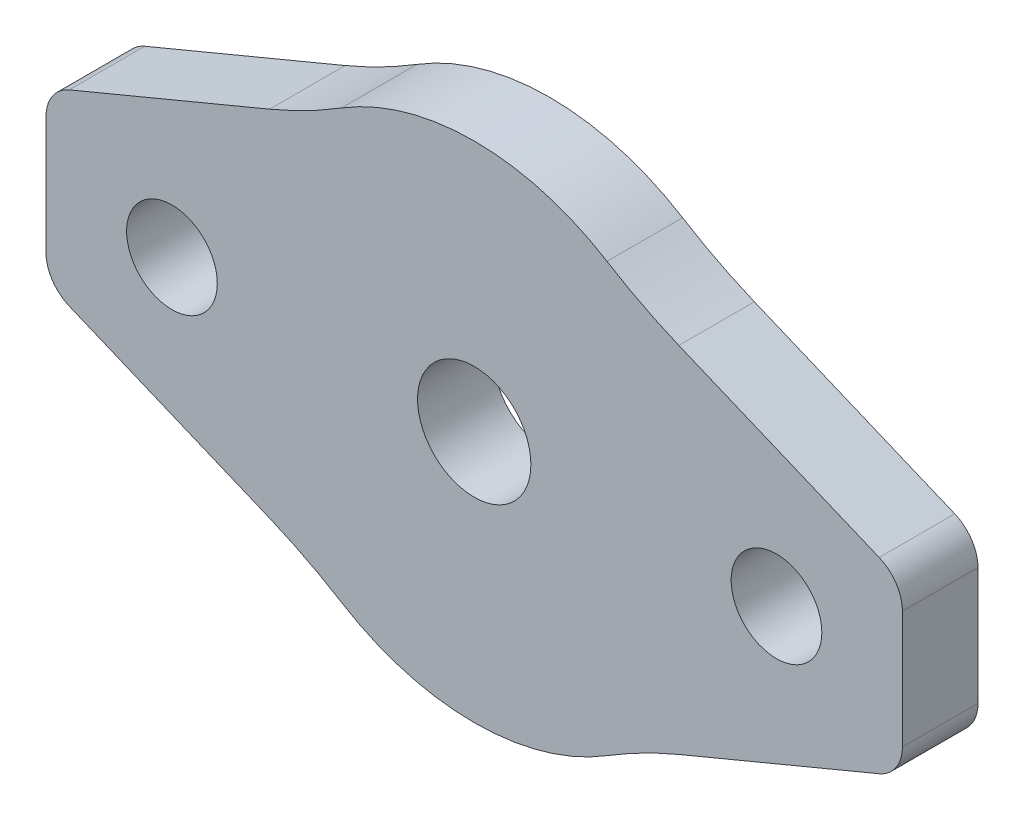
ISO-10303-21;
HEADER;
FILE_DESCRIPTION(('STEP AP214'),'2;1');
FILE_NAME('part.step','',(''),(''),'','','');
FILE_SCHEMA(('AUTOMOTIVE_DESIGN { 1 0 10303 214 1 1 1 1 }'));
ENDSEC;
DATA;
#1=APPLICATION_CONTEXT('core data for automotive mechanical design processes');
#2=APPLICATION_PROTOCOL_DEFINITION('international standard','automotive_design',2000,#1);
#3=PRODUCT_CONTEXT('',#1,'mechanical');
#4=PRODUCT('Part','Part','',(#3));
#5=PRODUCT_RELATED_PRODUCT_CATEGORY('part','',(#4));
#6=PRODUCT_DEFINITION_FORMATION('','',#4);
#7=PRODUCT_DEFINITION_CONTEXT('part definition',#1,'design');
#8=PRODUCT_DEFINITION('design','',#6,#7);
#9=PRODUCT_DEFINITION_SHAPE('','',#8);
#10=(LENGTH_UNIT() NAMED_UNIT(*) SI_UNIT(.MILLI.,.METRE.));
#11=(NAMED_UNIT(*) PLANE_ANGLE_UNIT() SI_UNIT($,.RADIAN.));
#12=(NAMED_UNIT(*) SI_UNIT($,.STERADIAN.) SOLID_ANGLE_UNIT());
#13=UNCERTAINTY_MEASURE_WITH_UNIT(LENGTH_MEASURE(1.E-05),#10,'distance_accuracy_value','');
#14=(GEOMETRIC_REPRESENTATION_CONTEXT(3) GLOBAL_UNCERTAINTY_ASSIGNED_CONTEXT((#13)) GLOBAL_UNIT_ASSIGNED_CONTEXT((#10,
#11,#12)) REPRESENTATION_CONTEXT('',''));
#15=CARTESIAN_POINT('',(0.,0.,0.));
#16=DIRECTION('',(0.,0.,1.));
#17=DIRECTION('',(1.,0.,0.));
#18=AXIS2_PLACEMENT_3D('',#15,#16,#17);
#19=CARTESIAN_POINT('',(-78.4823092369038,18.136457393352,3.));
#20=DIRECTION('',(0.,0.,-1.));
#21=DIRECTION('',(-1.,0.,0.));
#22=AXIS2_PLACEMENT_3D('',#19,#20,#21);
#23=CYLINDRICAL_SURFACE('',#22,10.);
#24=CARTESIAN_POINT('',(-78.4823092369038,18.136457393352,0.));
#25=DIRECTION('',(0.,0.,1.));
#26=DIRECTION('',(1.,0.,0.));
#27=AXIS2_PLACEMENT_3D('',#24,#25,#26);
#28=CIRCLE('',#27,10.);
#29=CARTESIAN_POINT('',(-73.2110997052458,26.6343600800953,0.));
#30=VERTEX_POINT('',#29);
#31=CARTESIAN_POINT('',(-83.7535187685618,26.6343600800953,0.));
#32=VERTEX_POINT('',#31);
#33=EDGE_CURVE('E198',#30,#32,#28,.T.);
#34=ORIENTED_EDGE('',*,*,#33,.T.);
#35=DIRECTION('',(0.,0.,-1.));
#36=VECTOR('',#35,1.);
#37=CARTESIAN_POINT('',(-83.7535187685618,26.6343600800953,3.));
#38=LINE('',#37,#36);
#39=CARTESIAN_POINT('',(-83.7535187685618,26.6343600800953,3.));
#40=VERTEX_POINT('',#39);
#41=EDGE_CURVE('E257',#32,#40,#38,.F.);
#42=ORIENTED_EDGE('',*,*,#41,.T.);
#43=CARTESIAN_POINT('',(-78.4823092369038,18.136457393352,3.));
#44=DIRECTION('',(0.,0.,1.));
#45=DIRECTION('',(1.,0.,0.));
#46=AXIS2_PLACEMENT_3D('',#43,#44,#45);
#47=CIRCLE('',#46,10.);
#48=CARTESIAN_POINT('',(-73.2110997052458,26.6343600800953,3.));
#49=VERTEX_POINT('',#48);
#50=EDGE_CURVE('E159',#49,#40,#47,.T.);
#51=ORIENTED_EDGE('',*,*,#50,.F.);
#52=DIRECTION('',(0.,0.,-1.));
#53=VECTOR('',#52,1.);
#54=CARTESIAN_POINT('',(-73.2110997052458,26.6343600800953,3.));
#55=LINE('',#54,#53);
#56=EDGE_CURVE('E254',#49,#30,#55,.T.);
#57=ORIENTED_EDGE('',*,*,#56,.T.);
#58=EDGE_LOOP('',(#34,#42,#51,#57));
#59=FACE_BOUND('',#58,.T.);
#60=ADVANCED_FACE('F35',(#59),#23,.T.);
#61=CARTESIAN_POINT('',(-84.7179179392774,25.9542054137785,3.));
#62=DIRECTION('',(0.384559093085243,-0.923100375866815,0.));
#63=DIRECTION('',(0.923100375866815,0.384559093085243,0.));
#64=AXIS2_PLACEMENT_3D('',#61,#62,#63);
#65=PLANE('',#64);
#66=DIRECTION('',(-0.923100375866815,-0.384559093085243,0.));
#67=VECTOR('',#66,1.);
#68=CARTESIAN_POINT('',(-84.7179179392774,25.9542054137785,3.));
#69=LINE('',#68,#67);
#70=CARTESIAN_POINT('',(-86.6047559701728,25.1681579362455,3.));
#71=VERTEX_POINT('',#70);
#72=CARTESIAN_POINT('',(-94.5591478765317,21.8543972472397,3.));
#73=VERTEX_POINT('',#72);
#74=EDGE_CURVE('E147',#71,#73,#69,.T.);
#75=ORIENTED_EDGE('',*,*,#74,.F.);
#76=DIRECTION('',(0.,0.,1.));
#77=VECTOR('',#76,1.);
#78=CARTESIAN_POINT('',(-86.6047559701728,25.1681579362455,0.));
#79=LINE('',#78,#77);
#80=CARTESIAN_POINT('',(-86.6047559701728,25.1681579362455,0.));
#81=VERTEX_POINT('',#80);
#82=EDGE_CURVE('E252',#71,#81,#79,.F.);
#83=ORIENTED_EDGE('',*,*,#82,.T.);
#84=DIRECTION('',(-0.923100375866815,-0.384559093085243,0.));
#85=VECTOR('',#84,1.);
#86=CARTESIAN_POINT('',(-84.7179179392774,25.9542054137785,0.));
#87=LINE('',#86,#85);
#88=CARTESIAN_POINT('',(-94.5591478765317,21.8543972472397,0.));
#89=VERTEX_POINT('',#88);
#90=EDGE_CURVE('E165',#81,#89,#87,.T.);
#91=ORIENTED_EDGE('',*,*,#90,.T.);
#92=DIRECTION('',(0.,0.,-1.));
#93=VECTOR('',#92,1.);
#94=CARTESIAN_POINT('',(-94.5591478765317,21.8543972472397,3.));
#95=LINE('',#94,#93);
#96=EDGE_CURVE('E162',#73,#89,#95,.T.);
#97=ORIENTED_EDGE('',*,*,#96,.F.);
#98=EDGE_LOOP('',(#75,#83,#91,#97));
#99=FACE_BOUND('',#98,.T.);
#100=ADVANCED_FACE('F163',(#99),#65,.F.);
#101=CARTESIAN_POINT('',(-93.9823092369038,20.4697466834395,3.));
#102=DIRECTION('',(0.,0.,-1.));
#103=DIRECTION('',(-1.,0.,0.));
#104=AXIS2_PLACEMENT_3D('',#101,#102,#103);
#105=CYLINDRICAL_SURFACE('',#104,1.5);
#106=CARTESIAN_POINT('',(-93.9823092369038,20.4697466834395,0.));
#107=DIRECTION('',(0.,0.,1.));
#108=DIRECTION('',(1.,0.,0.));
#109=AXIS2_PLACEMENT_3D('',#106,#107,#108);
#110=CIRCLE('',#109,1.5);
#111=CARTESIAN_POINT('',(-95.4823092369038,20.4697466834395,0.));
#112=VERTEX_POINT('',#111);
#113=EDGE_CURVE('E203',#89,#112,#110,.T.);
#114=ORIENTED_EDGE('',*,*,#113,.T.);
#115=DIRECTION('',(0.,0.,-1.));
#116=VECTOR('',#115,1.);
#117=CARTESIAN_POINT('',(-95.4823092369038,20.4697466834395,3.));
#118=LINE('',#117,#116);
#119=CARTESIAN_POINT('',(-95.4823092369038,20.4697466834395,3.));
#120=VERTEX_POINT('',#119);
#121=EDGE_CURVE('E169',#120,#112,#118,.T.);
#122=ORIENTED_EDGE('',*,*,#121,.F.);
#123=CARTESIAN_POINT('',(-93.9823092369038,20.4697466834395,3.));
#124=DIRECTION('',(0.,0.,1.));
#125=DIRECTION('',(1.,0.,0.));
#126=AXIS2_PLACEMENT_3D('',#123,#124,#125);
#127=CIRCLE('',#126,1.5);
#128=EDGE_CURVE('E151',#73,#120,#127,.T.);
#129=ORIENTED_EDGE('',*,*,#128,.F.);
#130=ORIENTED_EDGE('',*,*,#96,.T.);
#131=EDGE_LOOP('',(#114,#122,#129,#130));
#132=FACE_BOUND('',#131,.T.);
#133=ADVANCED_FACE('F171',(#132),#105,.T.);
#134=CARTESIAN_POINT('',(-95.4823092369038,20.4697466834395,3.));
#135=DIRECTION('',(1.,0.,0.));
#136=DIRECTION('',(0.,0.,-1.));
#137=AXIS2_PLACEMENT_3D('',#134,#135,#136);
#138=PLANE('',#137);
#139=DIRECTION('',(0.,-1.,0.));
#140=VECTOR('',#139,1.);
#141=CARTESIAN_POINT('',(-95.4823092369038,20.4697466834395,0.));
#142=LINE('',#141,#140);
#143=CARTESIAN_POINT('',(-95.4823092369038,15.8031681032646,0.));
#144=VERTEX_POINT('',#143);
#145=EDGE_CURVE('E205',#112,#144,#142,.T.);
#146=ORIENTED_EDGE('',*,*,#145,.T.);
#147=DIRECTION('',(0.,0.,-1.));
#148=VECTOR('',#147,1.);
#149=CARTESIAN_POINT('',(-95.4823092369038,15.8031681032646,3.));
#150=LINE('',#149,#148);
#151=CARTESIAN_POINT('',(-95.4823092369038,15.8031681032646,3.));
#152=VERTEX_POINT('',#151);
#153=EDGE_CURVE('E239',#152,#144,#150,.T.);
#154=ORIENTED_EDGE('',*,*,#153,.F.);
#155=DIRECTION('',(0.,-1.,0.));
#156=VECTOR('',#155,1.);
#157=CARTESIAN_POINT('',(-95.4823092369038,20.4697466834395,3.));
#158=LINE('',#157,#156);
#159=EDGE_CURVE('E174',#120,#152,#158,.T.);
#160=ORIENTED_EDGE('',*,*,#159,.F.);
#161=ORIENTED_EDGE('',*,*,#121,.T.);
#162=EDGE_LOOP('',(#146,#154,#160,#161));
#163=FACE_BOUND('',#162,.T.);
#164=ADVANCED_FACE('F394',(#163),#138,.F.);
#165=CARTESIAN_POINT('',(-93.9823092369038,15.8031681032646,3.));
#166=DIRECTION('',(0.,0.,-1.));
#167=DIRECTION('',(-1.,0.,0.));
#168=AXIS2_PLACEMENT_3D('',#165,#166,#167);
#169=CYLINDRICAL_SURFACE('',#168,1.5);
#170=CARTESIAN_POINT('',(-93.9823092369038,15.8031681032646,0.));
#171=DIRECTION('',(0.,0.,1.));
#172=DIRECTION('',(1.,0.,0.));
#173=AXIS2_PLACEMENT_3D('',#170,#171,#172);
#174=CIRCLE('',#173,1.5);
#175=CARTESIAN_POINT('',(-94.5591478765317,14.4185175394644,0.));
#176=VERTEX_POINT('',#175);
#177=EDGE_CURVE('E207',#144,#176,#174,.T.);
#178=ORIENTED_EDGE('',*,*,#177,.T.);
#179=DIRECTION('',(0.,0.,-1.));
#180=VECTOR('',#179,1.);
#181=CARTESIAN_POINT('',(-94.5591478765317,14.4185175394644,3.));
#182=LINE('',#181,#180);
#183=CARTESIAN_POINT('',(-94.5591478765317,14.4185175394644,3.));
#184=VERTEX_POINT('',#183);
#185=EDGE_CURVE('E236',#184,#176,#182,.T.);
#186=ORIENTED_EDGE('',*,*,#185,.F.);
#187=CARTESIAN_POINT('',(-93.9823092369038,15.8031681032646,3.));
#188=DIRECTION('',(0.,0.,1.));
#189=DIRECTION('',(1.,0.,0.));
#190=AXIS2_PLACEMENT_3D('',#187,#188,#189);
#191=CIRCLE('',#190,1.5);
#192=EDGE_CURVE('E176',#152,#184,#191,.T.);
#193=ORIENTED_EDGE('',*,*,#192,.F.);
#194=ORIENTED_EDGE('',*,*,#153,.T.);
#195=EDGE_LOOP('',(#178,#186,#193,#194));
#196=FACE_BOUND('',#195,.T.);
#197=ADVANCED_FACE('F390',(#196),#169,.T.);
#198=CARTESIAN_POINT('',(-84.7179179392774,10.3187093729256,3.));
#199=DIRECTION('',(0.384559093085243,0.923100375866815,0.));
#200=DIRECTION('',(-0.923100375866815,0.384559093085243,0.));
#201=AXIS2_PLACEMENT_3D('',#198,#199,#200);
#202=PLANE('',#201);
#203=DIRECTION('',(0.923100375866815,-0.384559093085243,0.));
#204=VECTOR('',#203,1.);
#205=CARTESIAN_POINT('',(-84.7179179392774,10.3187093729256,0.));
#206=LINE('',#205,#204);
#207=CARTESIAN_POINT('',(-86.6047559701728,11.1047568504586,0.));
#208=VERTEX_POINT('',#207);
#209=EDGE_CURVE('E209',#176,#208,#206,.T.);
#210=ORIENTED_EDGE('',*,*,#209,.T.);
#211=DIRECTION('',(0.,0.,1.));
#212=VECTOR('',#211,1.);
#213=CARTESIAN_POINT('',(-86.6047559701728,11.1047568504586,3.));
#214=LINE('',#213,#212);
#215=CARTESIAN_POINT('',(-86.6047559701728,11.1047568504586,3.));
#216=VERTEX_POINT('',#215);
#217=EDGE_CURVE('E250',#208,#216,#214,.T.);
#218=ORIENTED_EDGE('',*,*,#217,.T.);
#219=DIRECTION('',(0.923100375866815,-0.384559093085243,0.));
#220=VECTOR('',#219,1.);
#221=CARTESIAN_POINT('',(-84.7179179392774,10.3187093729256,3.));
#222=LINE('',#221,#220);
#223=EDGE_CURVE('E181',#184,#216,#222,.T.);
#224=ORIENTED_EDGE('',*,*,#223,.F.);
#225=ORIENTED_EDGE('',*,*,#185,.T.);
#226=EDGE_LOOP('',(#210,#218,#224,#225));
#227=FACE_BOUND('',#226,.T.);
#228=ADVANCED_FACE('F386',(#227),#202,.F.);
#229=CARTESIAN_POINT('',(-78.4823092369038,18.136457393352,3.));
#230=DIRECTION('',(0.,0.,-1.));
#231=DIRECTION('',(-1.,0.,0.));
#232=AXIS2_PLACEMENT_3D('',#229,#230,#231);
#233=CYLINDRICAL_SURFACE('',#232,10.);
#234=CARTESIAN_POINT('',(-78.4823092369038,18.136457393352,0.));
#235=DIRECTION('',(0.,0.,1.));
#236=DIRECTION('',(1.,0.,0.));
#237=AXIS2_PLACEMENT_3D('',#234,#235,#236);
#238=CIRCLE('',#237,10.);
#239=CARTESIAN_POINT('',(-83.7535187685618,9.63855470660879,0.));
#240=VERTEX_POINT('',#239);
#241=CARTESIAN_POINT('',(-73.2110997052458,9.63855470660878,0.));
#242=VERTEX_POINT('',#241);
#243=EDGE_CURVE('E212',#240,#242,#238,.T.);
#244=ORIENTED_EDGE('',*,*,#243,.T.);
#245=DIRECTION('',(0.,0.,-1.));
#246=VECTOR('',#245,1.);
#247=CARTESIAN_POINT('',(-73.2110997052458,9.63855470660878,3.));
#248=LINE('',#247,#246);
#249=CARTESIAN_POINT('',(-73.2110997052458,9.63855470660878,3.));
#250=VERTEX_POINT('',#249);
#251=EDGE_CURVE('E248',#242,#250,#248,.F.);
#252=ORIENTED_EDGE('',*,*,#251,.T.);
#253=CARTESIAN_POINT('',(-78.4823092369038,18.136457393352,3.));
#254=DIRECTION('',(0.,0.,1.));
#255=DIRECTION('',(1.,0.,0.));
#256=AXIS2_PLACEMENT_3D('',#253,#254,#255);
#257=CIRCLE('',#256,10.);
#258=CARTESIAN_POINT('',(-83.7535187685618,9.63855470660879,3.));
#259=VERTEX_POINT('',#258);
#260=EDGE_CURVE('E184',#259,#250,#257,.T.);
#261=ORIENTED_EDGE('',*,*,#260,.F.);
#262=DIRECTION('',(0.,0.,-1.));
#263=VECTOR('',#262,1.);
#264=CARTESIAN_POINT('',(-83.7535187685618,9.63855470660879,3.));
#265=LINE('',#264,#263);
#266=EDGE_CURVE('E245',#259,#240,#265,.T.);
#267=ORIENTED_EDGE('',*,*,#266,.T.);
#268=EDGE_LOOP('',(#244,#252,#261,#267));
#269=FACE_BOUND('',#268,.T.);
#270=ADVANCED_FACE('F383',(#269),#233,.T.);
#271=CARTESIAN_POINT('',(-62.4054705972759,14.4185175394644,3.));
#272=DIRECTION('',(-0.384559093085243,0.923100375866815,0.));
#273=DIRECTION('',(-0.923100375866815,-0.384559093085243,0.));
#274=AXIS2_PLACEMENT_3D('',#271,#272,#273);
#275=PLANE('',#274);
#276=DIRECTION('',(0.923100375866815,0.384559093085243,0.));
#277=VECTOR('',#276,1.);
#278=CARTESIAN_POINT('',(-62.4054705972759,14.4185175394644,3.));
#279=LINE('',#278,#277);
#280=CARTESIAN_POINT('',(-70.3598625036348,11.1047568504586,3.));
#281=VERTEX_POINT('',#280);
#282=CARTESIAN_POINT('',(-62.4054705972759,14.4185175394644,3.));
#283=VERTEX_POINT('',#282);
#284=EDGE_CURVE('E187',#281,#283,#279,.T.);
#285=ORIENTED_EDGE('',*,*,#284,.F.);
#286=DIRECTION('',(0.,0.,1.));
#287=VECTOR('',#286,1.);
#288=CARTESIAN_POINT('',(-70.3598625036348,11.1047568504586,0.));
#289=LINE('',#288,#287);
#290=CARTESIAN_POINT('',(-70.3598625036348,11.1047568504586,0.));
#291=VERTEX_POINT('',#290);
#292=EDGE_CURVE('E168',#281,#291,#289,.F.);
#293=ORIENTED_EDGE('',*,*,#292,.T.);
#294=DIRECTION('',(0.923100375866815,0.384559093085243,0.));
#295=VECTOR('',#294,1.);
#296=CARTESIAN_POINT('',(-62.4054705972759,14.4185175394644,0.));
#297=LINE('',#296,#295);
#298=CARTESIAN_POINT('',(-62.4054705972759,14.4185175394644,0.));
#299=VERTEX_POINT('',#298);
#300=EDGE_CURVE('E215',#291,#299,#297,.T.);
#301=ORIENTED_EDGE('',*,*,#300,.T.);
#302=DIRECTION('',(0.,0.,-1.));
#303=VECTOR('',#302,1.);
#304=CARTESIAN_POINT('',(-62.4054705972759,14.4185175394644,3.));
#305=LINE('',#304,#303);
#306=EDGE_CURVE('E233',#283,#299,#305,.T.);
#307=ORIENTED_EDGE('',*,*,#306,.F.);
#308=EDGE_LOOP('',(#285,#293,#301,#307));
#309=FACE_BOUND('',#308,.T.);
#310=ADVANCED_FACE('F311',(#309),#275,.F.);
#311=CARTESIAN_POINT('',(-62.9823092369037,15.8031681032646,3.));
#312=DIRECTION('',(0.,0.,-1.));
#313=DIRECTION('',(-1.,0.,0.));
#314=AXIS2_PLACEMENT_3D('',#311,#312,#313);
#315=CYLINDRICAL_SURFACE('',#314,1.5);
#316=CARTESIAN_POINT('',(-62.9823092369037,15.8031681032646,0.));
#317=DIRECTION('',(0.,0.,1.));
#318=DIRECTION('',(1.,0.,0.));
#319=AXIS2_PLACEMENT_3D('',#316,#317,#318);
#320=CIRCLE('',#319,1.5);
#321=CARTESIAN_POINT('',(-61.4823092369037,15.8031681032646,0.));
#322=VERTEX_POINT('',#321);
#323=EDGE_CURVE('E217',#299,#322,#320,.T.);
#324=ORIENTED_EDGE('',*,*,#323,.T.);
#325=DIRECTION('',(0.,0.,-1.));
#326=VECTOR('',#325,1.);
#327=CARTESIAN_POINT('',(-61.4823092369037,15.8031681032646,3.));
#328=LINE('',#327,#326);
#329=CARTESIAN_POINT('',(-61.4823092369037,15.8031681032646,3.));
#330=VERTEX_POINT('',#329);
#331=EDGE_CURVE('E230',#330,#322,#328,.T.);
#332=ORIENTED_EDGE('',*,*,#331,.F.);
#333=CARTESIAN_POINT('',(-62.9823092369037,15.8031681032646,3.));
#334=DIRECTION('',(0.,0.,1.));
#335=DIRECTION('',(1.,0.,0.));
#336=AXIS2_PLACEMENT_3D('',#333,#334,#335);
#337=CIRCLE('',#336,1.5);
#338=EDGE_CURVE('E189',#283,#330,#337,.T.);
#339=ORIENTED_EDGE('',*,*,#338,.F.);
#340=ORIENTED_EDGE('',*,*,#306,.T.);
#341=EDGE_LOOP('',(#324,#332,#339,#340));
#342=FACE_BOUND('',#341,.T.);
#343=ADVANCED_FACE('F317',(#342),#315,.T.);
#344=CARTESIAN_POINT('',(-61.4823092369037,20.4697466834395,3.));
#345=DIRECTION('',(-1.,0.,0.));
#346=DIRECTION('',(0.,0.,1.));
#347=AXIS2_PLACEMENT_3D('',#344,#345,#346);
#348=PLANE('',#347);
#349=DIRECTION('',(0.,1.,0.));
#350=VECTOR('',#349,1.);
#351=CARTESIAN_POINT('',(-61.4823092369037,20.4697466834395,0.));
#352=LINE('',#351,#350);
#353=CARTESIAN_POINT('',(-61.4823092369037,20.4697466834395,0.));
#354=VERTEX_POINT('',#353);
#355=EDGE_CURVE('E219',#322,#354,#352,.T.);
#356=ORIENTED_EDGE('',*,*,#355,.T.);
#357=DIRECTION('',(0.,0.,-1.));
#358=VECTOR('',#357,1.);
#359=CARTESIAN_POINT('',(-61.4823092369037,20.4697466834395,3.));
#360=LINE('',#359,#358);
#361=CARTESIAN_POINT('',(-61.4823092369037,20.4697466834395,3.));
#362=VERTEX_POINT('',#361);
#363=EDGE_CURVE('E227',#362,#354,#360,.T.);
#364=ORIENTED_EDGE('',*,*,#363,.F.);
#365=DIRECTION('',(0.,1.,0.));
#366=VECTOR('',#365,1.);
#367=CARTESIAN_POINT('',(-61.4823092369037,20.4697466834395,3.));
#368=LINE('',#367,#366);
#369=EDGE_CURVE('E191',#330,#362,#368,.T.);
#370=ORIENTED_EDGE('',*,*,#369,.F.);
#371=ORIENTED_EDGE('',*,*,#331,.T.);
#372=EDGE_LOOP('',(#356,#364,#370,#371));
#373=FACE_BOUND('',#372,.T.);
#374=ADVANCED_FACE('F323',(#373),#348,.F.);
#375=CARTESIAN_POINT('',(-62.9823092369037,20.4697466834395,3.));
#376=DIRECTION('',(0.,0.,-1.));
#377=DIRECTION('',(-1.,0.,0.));
#378=AXIS2_PLACEMENT_3D('',#375,#376,#377);
#379=CYLINDRICAL_SURFACE('',#378,1.5);
#380=CARTESIAN_POINT('',(-62.9823092369037,20.4697466834395,0.));
#381=DIRECTION('',(0.,0.,1.));
#382=DIRECTION('',(1.,0.,0.));
#383=AXIS2_PLACEMENT_3D('',#380,#381,#382);
#384=CIRCLE('',#383,1.5);
#385=CARTESIAN_POINT('',(-62.4054705972759,21.8543972472397,0.));
#386=VERTEX_POINT('',#385);
#387=EDGE_CURVE('E221',#354,#386,#384,.T.);
#388=ORIENTED_EDGE('',*,*,#387,.T.);
#389=DIRECTION('',(0.,0.,-1.));
#390=VECTOR('',#389,1.);
#391=CARTESIAN_POINT('',(-62.4054705972759,21.8543972472397,3.));
#392=LINE('',#391,#390);
#393=CARTESIAN_POINT('',(-62.4054705972759,21.8543972472397,3.));
#394=VERTEX_POINT('',#393);
#395=EDGE_CURVE('E197',#394,#386,#392,.T.);
#396=ORIENTED_EDGE('',*,*,#395,.F.);
#397=CARTESIAN_POINT('',(-62.9823092369037,20.4697466834395,3.));
#398=DIRECTION('',(0.,0.,1.));
#399=DIRECTION('',(1.,0.,0.));
#400=AXIS2_PLACEMENT_3D('',#397,#398,#399);
#401=CIRCLE('',#400,1.5);
#402=EDGE_CURVE('E193',#362,#394,#401,.T.);
#403=ORIENTED_EDGE('',*,*,#402,.F.);
#404=ORIENTED_EDGE('',*,*,#363,.T.);
#405=EDGE_LOOP('',(#388,#396,#403,#404));
#406=FACE_BOUND('',#405,.T.);
#407=ADVANCED_FACE('F327',(#406),#379,.T.);
#408=CARTESIAN_POINT('',(-62.4054705972759,21.8543972472397,3.));
#409=DIRECTION('',(-0.384559093085243,-0.923100375866815,0.));
#410=DIRECTION('',(0.923100375866815,-0.384559093085243,0.));
#411=AXIS2_PLACEMENT_3D('',#408,#409,#410);
#412=PLANE('',#411);
#413=DIRECTION('',(-0.923100375866815,0.384559093085243,0.));
#414=VECTOR('',#413,1.);
#415=CARTESIAN_POINT('',(-62.4054705972759,21.8543972472397,0.));
#416=LINE('',#415,#414);
#417=CARTESIAN_POINT('',(-70.3598625036348,25.1681579362455,0.));
#418=VERTEX_POINT('',#417);
#419=EDGE_CURVE('E223',#386,#418,#416,.T.);
#420=ORIENTED_EDGE('',*,*,#419,.T.);
#421=DIRECTION('',(0.,0.,1.));
#422=VECTOR('',#421,1.);
#423=CARTESIAN_POINT('',(-70.3598625036348,25.1681579362455,3.));
#424=LINE('',#423,#422);
#425=CARTESIAN_POINT('',(-70.3598625036348,25.1681579362455,3.));
#426=VERTEX_POINT('',#425);
#427=EDGE_CURVE('E50',#418,#426,#424,.T.);
#428=ORIENTED_EDGE('',*,*,#427,.T.);
#429=DIRECTION('',(-0.923100375866815,0.384559093085243,0.));
#430=VECTOR('',#429,1.);
#431=CARTESIAN_POINT('',(-62.4054705972759,21.8543972472397,3.));
#432=LINE('',#431,#430);
#433=EDGE_CURVE('E195',#394,#426,#432,.T.);
#434=ORIENTED_EDGE('',*,*,#433,.F.);
#435=ORIENTED_EDGE('',*,*,#395,.T.);
#436=EDGE_LOOP('',(#420,#428,#434,#435));
#437=FACE_BOUND('',#436,.T.);
#438=ADVANCED_FACE('F328',(#437),#412,.F.);
#439=CARTESIAN_POINT('',(-78.4823092369038,18.136457393352,3.));
#440=DIRECTION('',(0.,0.,1.));
#441=DIRECTION('',(1.,0.,0.));
#442=AXIS2_PLACEMENT_3D('',#439,#440,#441);
#443=PLANE('',#442);
#444=CARTESIAN_POINT('',(-90.4823092369038,18.136457393352,3.));
#445=DIRECTION('',(0.,0.,1.));
#446=DIRECTION('',(1.,0.,0.));
#447=AXIS2_PLACEMENT_3D('',#444,#445,#446);
#448=CIRCLE('',#447,1.79999999999999);
#449=CARTESIAN_POINT('',(-88.6823092369038,18.136457393352,3.));
#450=VERTEX_POINT('',#449);
#451=EDGE_CURVE('E343',#450,#450,#448,.T.);
#452=ORIENTED_EDGE('',*,*,#451,.F.);
#453=EDGE_LOOP('',(#452));
#454=FACE_BOUND('',#453,.T.);
#455=CARTESIAN_POINT('',(-66.4823092369038,18.136457393352,3.));
#456=DIRECTION('',(0.,0.,1.));
#457=DIRECTION('',(1.,0.,0.));
#458=AXIS2_PLACEMENT_3D('',#455,#456,#457);
#459=CIRCLE('',#458,1.79999999999999);
#460=CARTESIAN_POINT('',(-64.6823092369038,18.136457393352,3.));
#461=VERTEX_POINT('',#460);
#462=EDGE_CURVE('E337',#461,#461,#459,.T.);
#463=ORIENTED_EDGE('',*,*,#462,.F.);
#464=EDGE_LOOP('',(#463));
#465=FACE_BOUND('',#464,.T.);
#466=CARTESIAN_POINT('',(-78.4823092369038,18.136457393352,3.));
#467=DIRECTION('',(0.,0.,1.));
#468=DIRECTION('',(1.,0.,0.));
#469=AXIS2_PLACEMENT_3D('',#466,#467,#468);
#470=CIRCLE('',#469,2.25);
#471=CARTESIAN_POINT('',(-76.2323092369038,18.136457393352,3.));
#472=VERTEX_POINT('',#471);
#473=EDGE_CURVE('E331',#472,#472,#470,.T.);
#474=ORIENTED_EDGE('',*,*,#473,.F.);
#475=EDGE_LOOP('',(#474));
#476=FACE_BOUND('',#475,.T.);
#477=ORIENTED_EDGE('',*,*,#433,.T.);
#478=CARTESIAN_POINT('',(-62.66868064193,43.6301654535819,3.));
#479=DIRECTION('',(0.,0.,1.));
#480=DIRECTION('',(1.,0.,0.));
#481=AXIS2_PLACEMENT_3D('',#478,#479,#480);
#482=CIRCLE('',#481,20.);
#483=EDGE_CURVE('E11',#426,#49,#482,.F.);
#484=ORIENTED_EDGE('',*,*,#483,.T.);
#485=ORIENTED_EDGE('',*,*,#50,.T.);
#486=CARTESIAN_POINT('',(-94.2959378318777,43.6301654535818,3.));
#487=DIRECTION('',(0.,0.,1.));
#488=DIRECTION('',(1.,0.,0.));
#489=AXIS2_PLACEMENT_3D('',#486,#487,#488);
#490=CIRCLE('',#489,20.);
#491=EDGE_CURVE('E155',#40,#71,#490,.F.);
#492=ORIENTED_EDGE('',*,*,#491,.T.);
#493=ORIENTED_EDGE('',*,*,#74,.T.);
#494=ORIENTED_EDGE('',*,*,#128,.T.);
#495=ORIENTED_EDGE('',*,*,#159,.T.);
#496=ORIENTED_EDGE('',*,*,#192,.T.);
#497=ORIENTED_EDGE('',*,*,#223,.T.);
#498=CARTESIAN_POINT('',(-94.2959378318777,-7.3572506668777,3.));
#499=DIRECTION('',(0.,0.,1.));
#500=DIRECTION('',(1.,0.,0.));
#501=AXIS2_PLACEMENT_3D('',#498,#499,#500);
#502=CIRCLE('',#501,20.);
#503=EDGE_CURVE('E266',#216,#259,#502,.F.);
#504=ORIENTED_EDGE('',*,*,#503,.T.);
#505=ORIENTED_EDGE('',*,*,#260,.T.);
#506=CARTESIAN_POINT('',(-62.6686806419299,-7.35725066687775,3.));
#507=DIRECTION('',(0.,0.,1.));
#508=DIRECTION('',(1.,0.,0.));
#509=AXIS2_PLACEMENT_3D('',#506,#507,#508);
#510=CIRCLE('',#509,20.);
#511=EDGE_CURVE('E262',#250,#281,#510,.F.);
#512=ORIENTED_EDGE('',*,*,#511,.T.);
#513=ORIENTED_EDGE('',*,*,#284,.T.);
#514=ORIENTED_EDGE('',*,*,#338,.T.);
#515=ORIENTED_EDGE('',*,*,#369,.T.);
#516=ORIENTED_EDGE('',*,*,#402,.T.);
#517=EDGE_LOOP('',(#477,#484,#485,#492,#493,#494,#495,#496,#497,#504,#505,#512,#513,#514,#515,#516));
#518=FACE_BOUND('',#517,.T.);
#519=ADVANCED_FACE('F149',(#454,#465,#476,#518),#443,.T.);
#520=CARTESIAN_POINT('',(-78.4823092369038,18.136457393352,0.));
#521=DIRECTION('',(0.,0.,1.));
#522=DIRECTION('',(1.,0.,0.));
#523=AXIS2_PLACEMENT_3D('',#520,#521,#522);
#524=PLANE('',#523);
#525=CARTESIAN_POINT('',(-90.4823092369038,18.136457393352,0.));
#526=DIRECTION('',(0.,0.,1.));
#527=DIRECTION('',(1.,0.,0.));
#528=AXIS2_PLACEMENT_3D('',#525,#526,#527);
#529=CIRCLE('',#528,1.79999999999999);
#530=CARTESIAN_POINT('',(-88.6823092369038,18.136457393352,0.));
#531=VERTEX_POINT('',#530);
#532=EDGE_CURVE('E201',#531,#531,#529,.T.);
#533=ORIENTED_EDGE('',*,*,#532,.T.);
#534=EDGE_LOOP('',(#533));
#535=FACE_BOUND('',#534,.T.);
#536=CARTESIAN_POINT('',(-66.4823092369038,18.136457393352,0.));
#537=DIRECTION('',(0.,0.,1.));
#538=DIRECTION('',(1.,0.,0.));
#539=AXIS2_PLACEMENT_3D('',#536,#537,#538);
#540=CIRCLE('',#539,1.79999999999999);
#541=CARTESIAN_POINT('',(-64.6823092369038,18.136457393352,0.));
#542=VERTEX_POINT('',#541);
#543=EDGE_CURVE('E340',#542,#542,#540,.T.);
#544=ORIENTED_EDGE('',*,*,#543,.T.);
#545=EDGE_LOOP('',(#544));
#546=FACE_BOUND('',#545,.T.);
#547=CARTESIAN_POINT('',(-78.4823092369038,18.136457393352,0.));
#548=DIRECTION('',(0.,0.,1.));
#549=DIRECTION('',(1.,0.,0.));
#550=AXIS2_PLACEMENT_3D('',#547,#548,#549);
#551=CIRCLE('',#550,2.25);
#552=CARTESIAN_POINT('',(-76.2323092369038,18.136457393352,0.));
#553=VERTEX_POINT('',#552);
#554=EDGE_CURVE('E334',#553,#553,#551,.T.);
#555=ORIENTED_EDGE('',*,*,#554,.T.);
#556=EDGE_LOOP('',(#555));
#557=FACE_BOUND('',#556,.T.);
#558=ORIENTED_EDGE('',*,*,#33,.F.);
#559=CARTESIAN_POINT('',(-62.66868064193,43.6301654535819,0.));
#560=DIRECTION('',(0.,0.,1.));
#561=DIRECTION('',(1.,0.,0.));
#562=AXIS2_PLACEMENT_3D('',#559,#560,#561);
#563=CIRCLE('',#562,20.);
#564=EDGE_CURVE('E43',#30,#418,#563,.T.);
#565=ORIENTED_EDGE('',*,*,#564,.T.);
#566=ORIENTED_EDGE('',*,*,#419,.F.);
#567=ORIENTED_EDGE('',*,*,#387,.F.);
#568=ORIENTED_EDGE('',*,*,#355,.F.);
#569=ORIENTED_EDGE('',*,*,#323,.F.);
#570=ORIENTED_EDGE('',*,*,#300,.F.);
#571=CARTESIAN_POINT('',(-62.6686806419299,-7.35725066687775,0.));
#572=DIRECTION('',(0.,0.,1.));
#573=DIRECTION('',(1.,0.,0.));
#574=AXIS2_PLACEMENT_3D('',#571,#572,#573);
#575=CIRCLE('',#574,20.);
#576=EDGE_CURVE('E260',#291,#242,#575,.T.);
#577=ORIENTED_EDGE('',*,*,#576,.T.);
#578=ORIENTED_EDGE('',*,*,#243,.F.);
#579=CARTESIAN_POINT('',(-94.2959378318777,-7.3572506668777,0.));
#580=DIRECTION('',(0.,0.,1.));
#581=DIRECTION('',(1.,0.,0.));
#582=AXIS2_PLACEMENT_3D('',#579,#580,#581);
#583=CIRCLE('',#582,20.);
#584=EDGE_CURVE('E264',#240,#208,#583,.T.);
#585=ORIENTED_EDGE('',*,*,#584,.T.);
#586=ORIENTED_EDGE('',*,*,#209,.F.);
#587=ORIENTED_EDGE('',*,*,#177,.F.);
#588=ORIENTED_EDGE('',*,*,#145,.F.);
#589=ORIENTED_EDGE('',*,*,#113,.F.);
#590=ORIENTED_EDGE('',*,*,#90,.F.);
#591=CARTESIAN_POINT('',(-94.2959378318777,43.6301654535818,0.));
#592=DIRECTION('',(0.,0.,1.));
#593=DIRECTION('',(1.,0.,0.));
#594=AXIS2_PLACEMENT_3D('',#591,#592,#593);
#595=CIRCLE('',#594,20.);
#596=EDGE_CURVE('E268',#81,#32,#595,.T.);
#597=ORIENTED_EDGE('',*,*,#596,.T.);
#598=EDGE_LOOP('',(#558,#565,#566,#567,#568,#569,#570,#577,#578,#585,#586,#587,#588,#589,#590,#597));
#599=FACE_BOUND('',#598,.T.);
#600=ADVANCED_FACE('F270',(#535,#546,#557,#599),#524,.F.);
#601=CARTESIAN_POINT('',(-78.4823092369038,18.136457393352,0.));
#602=DIRECTION('',(0.,0.,1.));
#603=DIRECTION('',(1.,0.,0.));
#604=AXIS2_PLACEMENT_3D('',#601,#602,#603);
#605=CYLINDRICAL_SURFACE('',#604,2.25);
#606=ORIENTED_EDGE('',*,*,#554,.F.);
#607=EDGE_LOOP('',(#606));
#608=FACE_BOUND('',#607,.T.);
#609=ORIENTED_EDGE('',*,*,#473,.T.);
#610=EDGE_LOOP('',(#609));
#611=FACE_BOUND('',#610,.T.);
#612=ADVANCED_FACE('F360',(#608,#611),#605,.F.);
#613=CARTESIAN_POINT('',(-66.4823092369038,18.136457393352,0.));
#614=DIRECTION('',(0.,0.,1.));
#615=DIRECTION('',(1.,0.,0.));
#616=AXIS2_PLACEMENT_3D('',#613,#614,#615);
#617=CYLINDRICAL_SURFACE('',#616,1.79999999999999);
#618=ORIENTED_EDGE('',*,*,#543,.F.);
#619=EDGE_LOOP('',(#618));
#620=FACE_BOUND('',#619,.T.);
#621=ORIENTED_EDGE('',*,*,#462,.T.);
#622=EDGE_LOOP('',(#621));
#623=FACE_BOUND('',#622,.T.);
#624=ADVANCED_FACE('F301',(#620,#623),#617,.F.);
#625=CARTESIAN_POINT('',(-90.4823092369038,18.136457393352,0.));
#626=DIRECTION('',(0.,0.,1.));
#627=DIRECTION('',(1.,0.,0.));
#628=AXIS2_PLACEMENT_3D('',#625,#626,#627);
#629=CYLINDRICAL_SURFACE('',#628,1.79999999999999);
#630=ORIENTED_EDGE('',*,*,#532,.F.);
#631=EDGE_LOOP('',(#630));
#632=FACE_BOUND('',#631,.T.);
#633=ORIENTED_EDGE('',*,*,#451,.T.);
#634=EDGE_LOOP('',(#633));
#635=FACE_BOUND('',#634,.T.);
#636=ADVANCED_FACE('F296',(#632,#635),#629,.F.);
#637=CARTESIAN_POINT('',(-62.6686806419299,-7.35725066687775,3.));
#638=DIRECTION('',(0.,0.,-1.));
#639=DIRECTION('',(-1.,0.,0.));
#640=AXIS2_PLACEMENT_3D('',#637,#638,#639);
#641=CYLINDRICAL_SURFACE('',#640,20.);
#642=ORIENTED_EDGE('',*,*,#511,.F.);
#643=ORIENTED_EDGE('',*,*,#251,.F.);
#644=ORIENTED_EDGE('',*,*,#576,.F.);
#645=ORIENTED_EDGE('',*,*,#292,.F.);
#646=EDGE_LOOP('',(#642,#643,#644,#645));
#647=FACE_BOUND('',#646,.T.);
#648=ADVANCED_FACE('F284',(#647),#641,.F.);
#649=CARTESIAN_POINT('',(-94.2959378318777,-7.3572506668777,3.));
#650=DIRECTION('',(0.,0.,-1.));
#651=DIRECTION('',(-1.,0.,0.));
#652=AXIS2_PLACEMENT_3D('',#649,#650,#651);
#653=CYLINDRICAL_SURFACE('',#652,20.);
#654=ORIENTED_EDGE('',*,*,#503,.F.);
#655=ORIENTED_EDGE('',*,*,#217,.F.);
#656=ORIENTED_EDGE('',*,*,#584,.F.);
#657=ORIENTED_EDGE('',*,*,#266,.F.);
#658=EDGE_LOOP('',(#654,#655,#656,#657));
#659=FACE_BOUND('',#658,.T.);
#660=ADVANCED_FACE('F278',(#659),#653,.F.);
#661=CARTESIAN_POINT('',(-94.2959378318777,43.6301654535818,3.));
#662=DIRECTION('',(0.,0.,-1.));
#663=DIRECTION('',(-1.,0.,0.));
#664=AXIS2_PLACEMENT_3D('',#661,#662,#663);
#665=CYLINDRICAL_SURFACE('',#664,20.);
#666=ORIENTED_EDGE('',*,*,#491,.F.);
#667=ORIENTED_EDGE('',*,*,#41,.F.);
#668=ORIENTED_EDGE('',*,*,#596,.F.);
#669=ORIENTED_EDGE('',*,*,#82,.F.);
#670=EDGE_LOOP('',(#666,#667,#668,#669));
#671=FACE_BOUND('',#670,.T.);
#672=ADVANCED_FACE('F276',(#671),#665,.F.);
#673=CARTESIAN_POINT('',(-62.66868064193,43.6301654535819,3.));
#674=DIRECTION('',(0.,0.,-1.));
#675=DIRECTION('',(-1.,0.,0.));
#676=AXIS2_PLACEMENT_3D('',#673,#674,#675);
#677=CYLINDRICAL_SURFACE('',#676,20.);
#678=ORIENTED_EDGE('',*,*,#483,.F.);
#679=ORIENTED_EDGE('',*,*,#427,.F.);
#680=ORIENTED_EDGE('',*,*,#564,.F.);
#681=ORIENTED_EDGE('',*,*,#56,.F.);
#682=EDGE_LOOP('',(#678,#679,#680,#681));
#683=FACE_BOUND('',#682,.T.);
#684=ADVANCED_FACE('F37',(#683),#677,.F.);
#685=CLOSED_SHELL('',(#60,#100,#133,#164,#197,#228,#270,#310,#343,#374,#407,#438,#519,#600,#612,
#624,#636,#648,#660,#672,#684));
#686=MANIFOLD_SOLID_BREP('B2',#685);
#687=ADVANCED_BREP_SHAPE_REPRESENTATION('',(#18,#686),#14);
#688=SHAPE_DEFINITION_REPRESENTATION(#9,#687);
ENDSEC;
END-ISO-10303-21;
